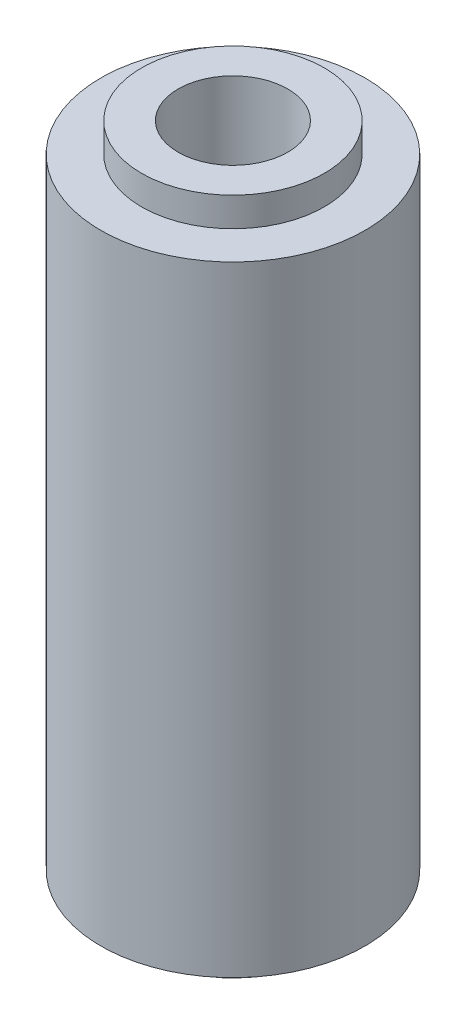
ISO-10303-21;
HEADER;
FILE_DESCRIPTION(('STEP AP214'),'2;1');
FILE_NAME('part.step','',(''),(''),'','','');
FILE_SCHEMA(('AUTOMOTIVE_DESIGN { 1 0 10303 214 1 1 1 1 }'));
ENDSEC;
DATA;
#1=APPLICATION_CONTEXT('core data for automotive mechanical design processes');
#2=APPLICATION_PROTOCOL_DEFINITION('international standard','automotive_design',2000,#1);
#3=PRODUCT_CONTEXT('',#1,'mechanical');
#4=PRODUCT('Part','Part','',(#3));
#5=PRODUCT_RELATED_PRODUCT_CATEGORY('part','',(#4));
#6=PRODUCT_DEFINITION_FORMATION('','',#4);
#7=PRODUCT_DEFINITION_CONTEXT('part definition',#1,'design');
#8=PRODUCT_DEFINITION('design','',#6,#7);
#9=PRODUCT_DEFINITION_SHAPE('','',#8);
#10=(LENGTH_UNIT() NAMED_UNIT(*) SI_UNIT(.MILLI.,.METRE.));
#11=(NAMED_UNIT(*) PLANE_ANGLE_UNIT() SI_UNIT($,.RADIAN.));
#12=(NAMED_UNIT(*) SI_UNIT($,.STERADIAN.) SOLID_ANGLE_UNIT());
#13=UNCERTAINTY_MEASURE_WITH_UNIT(LENGTH_MEASURE(1.E-05),#10,'distance_accuracy_value','');
#14=(GEOMETRIC_REPRESENTATION_CONTEXT(3) GLOBAL_UNCERTAINTY_ASSIGNED_CONTEXT((#13)) GLOBAL_UNIT_ASSIGNED_CONTEXT((#10,
#11,#12)) REPRESENTATION_CONTEXT('',''));
#15=CARTESIAN_POINT('',(0.,0.,0.));
#16=DIRECTION('',(0.,0.,1.));
#17=DIRECTION('',(1.,0.,0.));
#18=AXIS2_PLACEMENT_3D('',#15,#16,#17);
#19=CARTESIAN_POINT('',(0.,9.525,0.));
#20=DIRECTION('',(0.,-1.,0.));
#21=DIRECTION('',(0.,0.,-1.));
#22=AXIS2_PLACEMENT_3D('',#19,#20,#21);
#23=CYLINDRICAL_SURFACE('',#22,3.9751);
#24=CARTESIAN_POINT('',(0.,9.325,0.));
#25=DIRECTION('',(0.,1.,0.));
#26=DIRECTION('',(0.,0.,1.));
#27=AXIS2_PLACEMENT_3D('',#24,#25,#26);
#28=CIRCLE('',#27,3.9751);
#29=CARTESIAN_POINT('',(0.,9.325,-3.9751));
#30=VERTEX_POINT('',#29);
#31=EDGE_CURVE('E68',#30,#30,#28,.T.);
#32=CARTESIAN_POINT('',(0.,-9.325,0.));
#33=DIRECTION('',(0.,-1.,0.));
#34=DIRECTION('',(0.,0.,-1.));
#35=AXIS2_PLACEMENT_3D('',#32,#33,#34);
#36=CIRCLE('',#35,3.9751);
#37=CARTESIAN_POINT('',(0.,-9.325,-3.9751));
#38=VERTEX_POINT('',#37);
#39=EDGE_CURVE('E76',#38,#38,#36,.T.);
#40=CARTESIAN_POINT('',(0.,9.325,-3.9751));
#41=CARTESIAN_POINT('',(0.,9.13072916666667,-3.9751));
#42=CARTESIAN_POINT('',(0.,8.93645833333333,-3.9751));
#43=CARTESIAN_POINT('',(0.,8.54791666666667,-3.9751));
#44=CARTESIAN_POINT('',(0.,8.35364583333333,-3.9751));
#45=CARTESIAN_POINT('',(0.,7.96510416666667,-3.9751));
#46=CARTESIAN_POINT('',(0.,7.77083333333333,-3.9751));
#47=CARTESIAN_POINT('',(0.,7.38229166666667,-3.9751));
#48=CARTESIAN_POINT('',(0.,7.18802083333333,-3.9751));
#49=CARTESIAN_POINT('',(0.,6.79947916666667,-3.9751));
#50=CARTESIAN_POINT('',(0.,6.60520833333333,-3.9751));
#51=CARTESIAN_POINT('',(0.,6.21666666666667,-3.9751));
#52=CARTESIAN_POINT('',(0.,6.02239583333333,-3.9751));
#53=CARTESIAN_POINT('',(0.,5.63385416666667,-3.9751));
#54=CARTESIAN_POINT('',(0.,5.43958333333333,-3.9751));
#55=CARTESIAN_POINT('',(0.,5.05104166666667,-3.9751));
#56=CARTESIAN_POINT('',(0.,4.85677083333333,-3.9751));
#57=CARTESIAN_POINT('',(0.,4.46822916666667,-3.9751));
#58=CARTESIAN_POINT('',(0.,4.27395833333333,-3.9751));
#59=CARTESIAN_POINT('',(0.,3.88541666666667,-3.9751));
#60=CARTESIAN_POINT('',(0.,3.69114583333333,-3.9751));
#61=CARTESIAN_POINT('',(0.,3.30260416666667,-3.9751));
#62=CARTESIAN_POINT('',(0.,3.10833333333333,-3.9751));
#63=CARTESIAN_POINT('',(0.,2.71979166666667,-3.9751));
#64=CARTESIAN_POINT('',(0.,2.52552083333333,-3.9751));
#65=CARTESIAN_POINT('',(0.,2.13697916666667,-3.9751));
#66=CARTESIAN_POINT('',(0.,1.94270833333333,-3.9751));
#67=CARTESIAN_POINT('',(0.,1.55416666666666,-3.9751));
#68=CARTESIAN_POINT('',(0.,1.35989583333333,-3.9751));
#69=CARTESIAN_POINT('',(0.,0.971354166666665,-3.9751));
#70=CARTESIAN_POINT('',(0.,0.777083333333332,-3.9751));
#71=CARTESIAN_POINT('',(0.,0.388541666666665,-3.9751));
#72=CARTESIAN_POINT('',(0.,0.194270833333332,-3.9751));
#73=CARTESIAN_POINT('',(0.,-0.194270833333335,-3.9751));
#74=CARTESIAN_POINT('',(0.,-0.388541666666668,-3.9751));
#75=CARTESIAN_POINT('',(0.,-0.777083333333335,-3.9751));
#76=CARTESIAN_POINT('',(0.,-0.971354166666668,-3.9751));
#77=CARTESIAN_POINT('',(0.,-1.35989583333334,-3.9751));
#78=CARTESIAN_POINT('',(0.,-1.55416666666667,-3.9751));
#79=CARTESIAN_POINT('',(0.,-1.94270833333334,-3.9751));
#80=CARTESIAN_POINT('',(0.,-2.13697916666667,-3.9751));
#81=CARTESIAN_POINT('',(0.,-2.52552083333333,-3.9751));
#82=CARTESIAN_POINT('',(0.,-2.71979166666667,-3.9751));
#83=CARTESIAN_POINT('',(0.,-3.10833333333333,-3.9751));
#84=CARTESIAN_POINT('',(0.,-3.30260416666667,-3.9751));
#85=CARTESIAN_POINT('',(0.,-3.69114583333333,-3.9751));
#86=CARTESIAN_POINT('',(0.,-3.88541666666667,-3.9751));
#87=CARTESIAN_POINT('',(0.,-4.27395833333334,-3.9751));
#88=CARTESIAN_POINT('',(0.,-4.46822916666667,-3.9751));
#89=CARTESIAN_POINT('',(0.,-4.85677083333334,-3.9751));
#90=CARTESIAN_POINT('',(0.,-5.05104166666667,-3.9751));
#91=CARTESIAN_POINT('',(0.,-5.43958333333334,-3.9751));
#92=CARTESIAN_POINT('',(0.,-5.63385416666667,-3.9751));
#93=CARTESIAN_POINT('',(0.,-6.02239583333334,-3.9751));
#94=CARTESIAN_POINT('',(0.,-6.21666666666667,-3.9751));
#95=CARTESIAN_POINT('',(0.,-6.60520833333333,-3.9751));
#96=CARTESIAN_POINT('',(0.,-6.79947916666667,-3.9751));
#97=CARTESIAN_POINT('',(0.,-7.18802083333333,-3.9751));
#98=CARTESIAN_POINT('',(0.,-7.38229166666667,-3.9751));
#99=CARTESIAN_POINT('',(0.,-7.77083333333333,-3.9751));
#100=CARTESIAN_POINT('',(0.,-7.96510416666667,-3.9751));
#101=CARTESIAN_POINT('',(0.,-8.35364583333333,-3.9751));
#102=CARTESIAN_POINT('',(0.,-8.54791666666667,-3.9751));
#103=CARTESIAN_POINT('',(0.,-8.93645833333333,-3.9751));
#104=CARTESIAN_POINT('',(0.,-9.13072916666667,-3.9751));
#105=CARTESIAN_POINT('',(0.,-9.325,-3.9751));
#106=B_SPLINE_CURVE_WITH_KNOTS('',3,(#40,#41,#42,#43,#44,#45,#46,#47,#48,#49,#50,#51,#52,#53,
#54,#55,#56,#57,#58,#59,#60,#61,#62,#63,#64,#65,#66,#67,#68,#69,#70,#71,#72,#73,#74,#75,#76,#77,
#78,#79,#80,#81,#82,#83,#84,#85,#86,#87,#88,#89,#90,#91,#92,#93,#94,#95,#96,#97,#98,#99,#100,
#101,#102,#103,#104,#105),.UNSPECIFIED.,.F.,.F.,(4,2,2,2,2,2,2,2,2,2,2,2,2,2,2,2,2,2,2,2,2,2,2,
2,2,2,2,2,2,2,2,2,4),(0.,0.5828125,1.165625,1.7484375,2.33125,2.9140625,3.496875,4.0796875,
4.6625,5.2453125,5.828125,6.4109375,6.99375,7.5765625,8.159375,8.7421875,9.325,9.9078125,
10.490625,11.0734375,11.65625,12.2390625,12.821875,13.4046875,13.9875,14.5703125,15.153125,
15.7359375,16.31875,16.9015625,17.484375,18.0671875,18.65),.UNSPECIFIED.);
#107=EDGE_CURVE('BSEAM45',#30,#38,#106,.T.);
#108=ORIENTED_EDGE('',*,*,#31,.F.);
#109=ORIENTED_EDGE('',*,*,#39,.F.);
#110=ORIENTED_EDGE('',*,*,#107,.T.);
#111=ORIENTED_EDGE('',*,*,#107,.F.);
#112=EDGE_LOOP('',(#108,#110,#109,#111));
#113=FACE_BOUND('',#112,.T.);
#114=ADVANCED_FACE('F45',(#113),#23,.T.);
#115=CARTESIAN_POINT('',(0.,-18.653174593052,0.));
#116=DIRECTION('',(0.,1.,0.));
#117=DIRECTION('',(0.,0.,1.));
#118=AXIS2_PLACEMENT_3D('',#115,#116,#117);
#119=CYLINDRICAL_SURFACE('',#118,2.75);
#120=CARTESIAN_POINT('',(0.,-10.2,0.));
#121=DIRECTION('',(0.,1.,0.));
#122=DIRECTION('',(0.,0.,1.));
#123=AXIS2_PLACEMENT_3D('',#120,#121,#122);
#124=CIRCLE('',#123,2.75);
#125=CARTESIAN_POINT('',(0.,-10.2,2.75));
#126=VERTEX_POINT('',#125);
#127=EDGE_CURVE('E52',#126,#126,#124,.F.);
#128=ORIENTED_EDGE('',*,*,#127,.F.);
#129=EDGE_LOOP('',(#128));
#130=FACE_BOUND('',#129,.T.);
#131=CARTESIAN_POINT('',(0.,-9.325,0.));
#132=DIRECTION('',(0.,-1.,0.));
#133=DIRECTION('',(0.,0.,-1.));
#134=AXIS2_PLACEMENT_3D('',#131,#132,#133);
#135=CIRCLE('',#134,2.75);
#136=CARTESIAN_POINT('',(0.,-9.325,-2.75));
#137=VERTEX_POINT('',#136);
#138=EDGE_CURVE('E80',#137,#137,#135,.T.);
#139=ORIENTED_EDGE('',*,*,#138,.T.);
#140=EDGE_LOOP('',(#139));
#141=FACE_BOUND('',#140,.T.);
#142=ADVANCED_FACE('F85',(#130,#141),#119,.T.);
#143=CARTESIAN_POINT('',(0.,-10.2,0.));
#144=DIRECTION('',(0.,1.,0.));
#145=DIRECTION('',(0.,0.,1.));
#146=AXIS2_PLACEMENT_3D('',#143,#144,#145);
#147=PLANE('',#146);
#148=ORIENTED_EDGE('',*,*,#127,.T.);
#149=EDGE_LOOP('',(#148));
#150=FACE_BOUND('',#149,.T.);
#151=CARTESIAN_POINT('',(0.,-10.2,0.));
#152=DIRECTION('',(0.,1.,0.));
#153=DIRECTION('',(0.,0.,1.));
#154=AXIS2_PLACEMENT_3D('',#151,#152,#153);
#155=CIRCLE('',#154,1.65);
#156=CARTESIAN_POINT('',(0.,-10.2,1.65));
#157=VERTEX_POINT('',#156);
#158=EDGE_CURVE('E11',#157,#157,#155,.F.);
#159=ORIENTED_EDGE('',*,*,#158,.F.);
#160=EDGE_LOOP('',(#159));
#161=FACE_BOUND('',#160,.T.);
#162=ADVANCED_FACE('F100',(#150,#161),#147,.F.);
#163=CARTESIAN_POINT('',(0.,9.525,0.));
#164=DIRECTION('',(0.,1.,0.));
#165=DIRECTION('',(0.,0.,1.));
#166=AXIS2_PLACEMENT_3D('',#163,#164,#165);
#167=CYLINDRICAL_SURFACE('',#166,1.65);
#168=ORIENTED_EDGE('',*,*,#158,.T.);
#169=EDGE_LOOP('',(#168));
#170=FACE_BOUND('',#169,.T.);
#171=CARTESIAN_POINT('',(0.,10.2,0.));
#172=DIRECTION('',(0.,1.,0.));
#173=DIRECTION('',(0.,0.,1.));
#174=AXIS2_PLACEMENT_3D('',#171,#172,#173);
#175=CIRCLE('',#174,1.65);
#176=CARTESIAN_POINT('',(0.,10.2,1.65));
#177=VERTEX_POINT('',#176);
#178=EDGE_CURVE('E62',#177,#177,#175,.T.);
#179=ORIENTED_EDGE('',*,*,#178,.T.);
#180=EDGE_LOOP('',(#179));
#181=FACE_BOUND('',#180,.T.);
#182=ADVANCED_FACE('F118',(#170,#181),#167,.F.);
#183=CARTESIAN_POINT('',(0.,10.2,0.));
#184=DIRECTION('',(0.,1.,0.));
#185=DIRECTION('',(0.,0.,1.));
#186=AXIS2_PLACEMENT_3D('',#183,#184,#185);
#187=CIRCLE('',#186,2.75);
#188=CARTESIAN_POINT('',(0.,10.2,2.75));
#189=VERTEX_POINT('',#188);
#190=EDGE_CURVE('E57',#189,#189,#187,.T.);
#191=ORIENTED_EDGE('',*,*,#190,.F.);
#192=EDGE_LOOP('',(#191));
#193=FACE_BOUND('',#192,.T.);
#194=CARTESIAN_POINT('',(0.,9.325,0.));
#195=DIRECTION('',(0.,1.,0.));
#196=DIRECTION('',(0.,0.,1.));
#197=AXIS2_PLACEMENT_3D('',#194,#195,#196);
#198=CIRCLE('',#197,2.75);
#199=CARTESIAN_POINT('',(0.,9.325,2.75));
#200=VERTEX_POINT('',#199);
#201=EDGE_CURVE('E72',#200,#200,#198,.T.);
#202=ORIENTED_EDGE('',*,*,#201,.T.);
#203=EDGE_LOOP('',(#202));
#204=FACE_BOUND('',#203,.T.);
#205=ADVANCED_FACE('F103',(#193,#204),#119,.T.);
#206=CARTESIAN_POINT('',(0.,10.2,0.));
#207=DIRECTION('',(0.,1.,0.));
#208=DIRECTION('',(0.,0.,1.));
#209=AXIS2_PLACEMENT_3D('',#206,#207,#208);
#210=PLANE('',#209);
#211=ORIENTED_EDGE('',*,*,#190,.T.);
#212=EDGE_LOOP('',(#211));
#213=FACE_BOUND('',#212,.T.);
#214=ORIENTED_EDGE('',*,*,#178,.F.);
#215=EDGE_LOOP('',(#214));
#216=FACE_BOUND('',#215,.T.);
#217=ADVANCED_FACE('F106',(#213,#216),#210,.T.);
#218=CARTESIAN_POINT('',(0.,9.325,0.));
#219=DIRECTION('',(0.,1.,0.));
#220=DIRECTION('',(0.,0.,1.));
#221=AXIS2_PLACEMENT_3D('',#218,#219,#220);
#222=PLANE('',#221);
#223=ORIENTED_EDGE('',*,*,#201,.F.);
#224=EDGE_LOOP('',(#223));
#225=FACE_BOUND('',#224,.T.);
#226=ORIENTED_EDGE('',*,*,#31,.T.);
#227=EDGE_LOOP('',(#226));
#228=FACE_BOUND('',#227,.T.);
#229=ADVANCED_FACE('F90',(#225,#228),#222,.T.);
#230=CARTESIAN_POINT('',(0.,-9.325,0.));
#231=DIRECTION('',(0.,-1.,0.));
#232=DIRECTION('',(0.,0.,-1.));
#233=AXIS2_PLACEMENT_3D('',#230,#231,#232);
#234=PLANE('',#233);
#235=ORIENTED_EDGE('',*,*,#138,.F.);
#236=EDGE_LOOP('',(#235));
#237=FACE_BOUND('',#236,.T.);
#238=ORIENTED_EDGE('',*,*,#39,.T.);
#239=EDGE_LOOP('',(#238));
#240=FACE_BOUND('',#239,.T.);
#241=ADVANCED_FACE('F87',(#237,#240),#234,.T.);
#242=CLOSED_SHELL('',(#114,#142,#162,#182,#205,#217,#229,#241));
#243=MANIFOLD_SOLID_BREP('B2',#242);
#244=ADVANCED_BREP_SHAPE_REPRESENTATION('',(#18,#243),#14);
#245=SHAPE_DEFINITION_REPRESENTATION(#9,#244);
ENDSEC;
END-ISO-10303-21;
